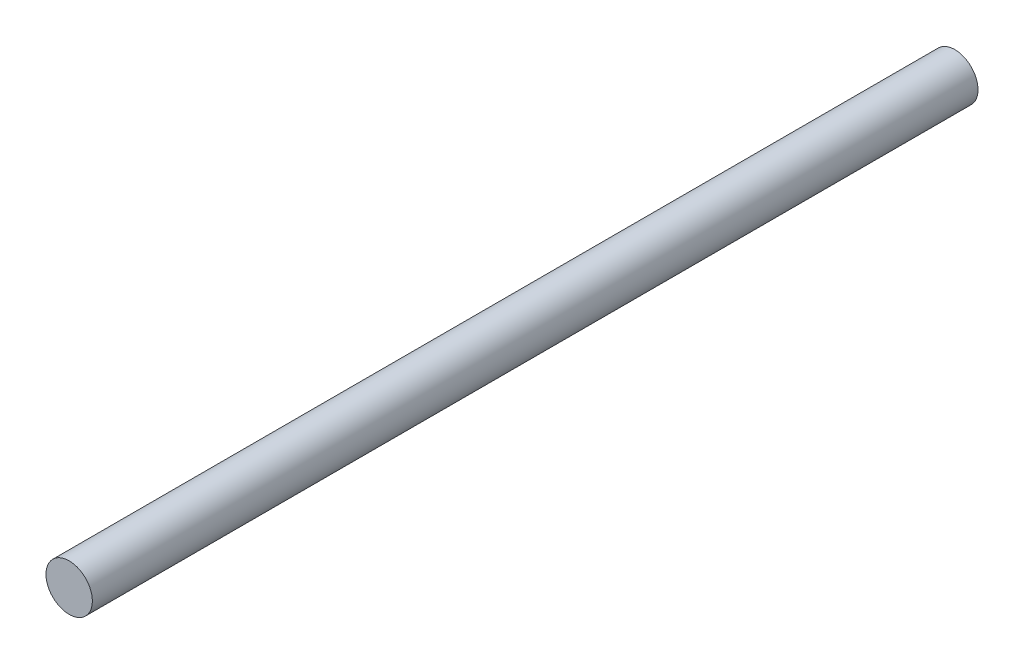
ISO-10303-21;
HEADER;
FILE_DESCRIPTION(('STEP AP214'),'2;1');
FILE_NAME('part.step','',(''),(''),'','','');
FILE_SCHEMA(('AUTOMOTIVE_DESIGN { 1 0 10303 214 1 1 1 1 }'));
ENDSEC;
DATA;
#1=APPLICATION_CONTEXT('core data for automotive mechanical design processes');
#2=APPLICATION_PROTOCOL_DEFINITION('international standard','automotive_design',2000,#1);
#3=PRODUCT_CONTEXT('',#1,'mechanical');
#4=PRODUCT('Part','Part','',(#3));
#5=PRODUCT_RELATED_PRODUCT_CATEGORY('part','',(#4));
#6=PRODUCT_DEFINITION_FORMATION('','',#4);
#7=PRODUCT_DEFINITION_CONTEXT('part definition',#1,'design');
#8=PRODUCT_DEFINITION('design','',#6,#7);
#9=PRODUCT_DEFINITION_SHAPE('','',#8);
#10=(LENGTH_UNIT() NAMED_UNIT(*) SI_UNIT(.MILLI.,.METRE.));
#11=(NAMED_UNIT(*) PLANE_ANGLE_UNIT() SI_UNIT($,.RADIAN.));
#12=(NAMED_UNIT(*) SI_UNIT($,.STERADIAN.) SOLID_ANGLE_UNIT());
#13=UNCERTAINTY_MEASURE_WITH_UNIT(LENGTH_MEASURE(1.E-05),#10,'distance_accuracy_value','');
#14=(GEOMETRIC_REPRESENTATION_CONTEXT(3) GLOBAL_UNCERTAINTY_ASSIGNED_CONTEXT((#13)) GLOBAL_UNIT_ASSIGNED_CONTEXT((#10,
#11,#12)) REPRESENTATION_CONTEXT('',''));
#15=CARTESIAN_POINT('',(0.,0.,0.));
#16=DIRECTION('',(0.,0.,1.));
#17=DIRECTION('',(1.,0.,0.));
#18=AXIS2_PLACEMENT_3D('',#15,#16,#17);
#19=CARTESIAN_POINT('',(0.,0.,114.5));
#20=DIRECTION('',(0.,0.,-1.));
#21=DIRECTION('',(-1.,0.,0.));
#22=AXIS2_PLACEMENT_3D('',#19,#20,#21);
#23=CYLINDRICAL_SURFACE('',#22,3.);
#24=CARTESIAN_POINT('',(0.,0.,114.5));
#25=DIRECTION('',(0.,0.,1.));
#26=DIRECTION('',(1.,0.,0.));
#27=AXIS2_PLACEMENT_3D('',#24,#25,#26);
#28=CIRCLE('',#27,3.);
#29=CARTESIAN_POINT('',(3.,0.,114.5));
#30=VERTEX_POINT('',#29);
#31=EDGE_CURVE('E10',#30,#30,#28,.T.);
#32=ORIENTED_EDGE('',*,*,#31,.F.);
#33=EDGE_LOOP('',(#32));
#34=FACE_BOUND('',#33,.T.);
#35=CARTESIAN_POINT('',(0.,0.,0.));
#36=DIRECTION('',(0.,0.,1.));
#37=DIRECTION('',(1.,0.,0.));
#38=AXIS2_PLACEMENT_3D('',#35,#36,#37);
#39=CIRCLE('',#38,3.);
#40=CARTESIAN_POINT('',(3.,0.,0.));
#41=VERTEX_POINT('',#40);
#42=EDGE_CURVE('E33',#41,#41,#39,.T.);
#43=ORIENTED_EDGE('',*,*,#42,.T.);
#44=EDGE_LOOP('',(#43));
#45=FACE_BOUND('',#44,.T.);
#46=ADVANCED_FACE('F30',(#34,#45),#23,.T.);
#47=CARTESIAN_POINT('',(0.,0.,114.5));
#48=DIRECTION('',(0.,0.,1.));
#49=DIRECTION('',(1.,0.,0.));
#50=AXIS2_PLACEMENT_3D('',#47,#48,#49);
#51=PLANE('',#50);
#52=ORIENTED_EDGE('',*,*,#31,.T.);
#53=EDGE_LOOP('',(#52));
#54=FACE_BOUND('',#53,.T.);
#55=ADVANCED_FACE('F45',(#54),#51,.T.);
#56=CARTESIAN_POINT('',(0.,0.,0.));
#57=DIRECTION('',(0.,0.,1.));
#58=DIRECTION('',(1.,0.,0.));
#59=AXIS2_PLACEMENT_3D('',#56,#57,#58);
#60=PLANE('',#59);
#61=ORIENTED_EDGE('',*,*,#42,.F.);
#62=EDGE_LOOP('',(#61));
#63=FACE_BOUND('',#62,.T.);
#64=ADVANCED_FACE('F43',(#63),#60,.F.);
#65=CLOSED_SHELL('',(#46,#55,#64));
#66=MANIFOLD_SOLID_BREP('B2',#65);
#67=ADVANCED_BREP_SHAPE_REPRESENTATION('',(#18,#66),#14);
#68=SHAPE_DEFINITION_REPRESENTATION(#9,#67);
ENDSEC;
END-ISO-10303-21;
